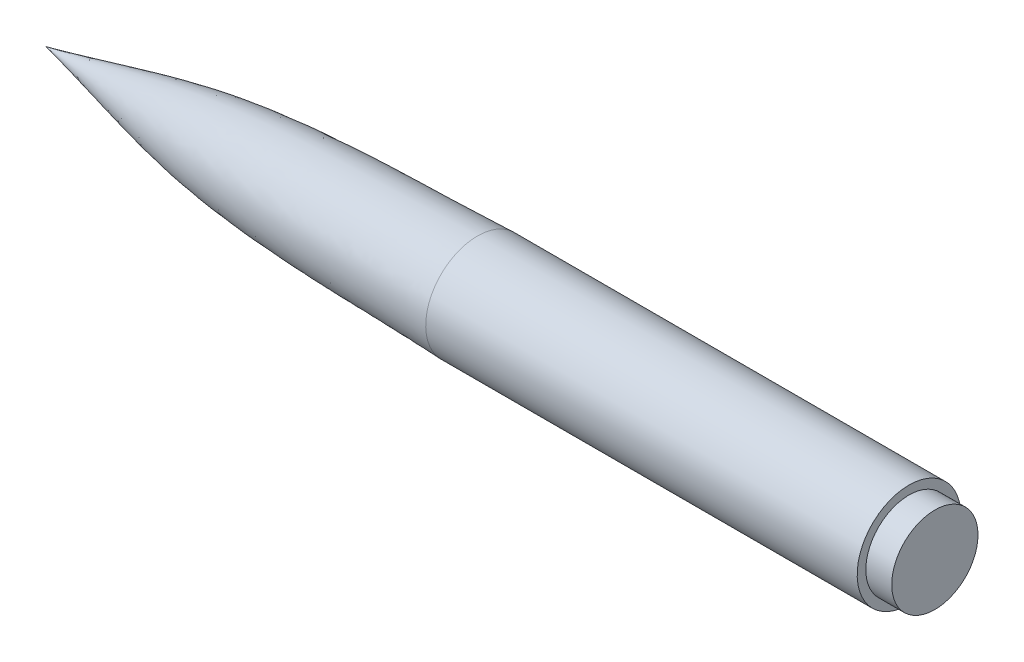
ISO-10303-21;
HEADER;
FILE_DESCRIPTION(('STEP AP214'),'2;1');
FILE_NAME('part.step','',(''),(''),'','','');
FILE_SCHEMA(('AUTOMOTIVE_DESIGN { 1 0 10303 214 1 1 1 1 }'));
ENDSEC;
DATA;
#1=APPLICATION_CONTEXT('core data for automotive mechanical design processes');
#2=APPLICATION_PROTOCOL_DEFINITION('international standard','automotive_design',2000,#1);
#3=PRODUCT_CONTEXT('',#1,'mechanical');
#4=PRODUCT('Part','Part','',(#3));
#5=PRODUCT_RELATED_PRODUCT_CATEGORY('part','',(#4));
#6=PRODUCT_DEFINITION_FORMATION('','',#4);
#7=PRODUCT_DEFINITION_CONTEXT('part definition',#1,'design');
#8=PRODUCT_DEFINITION('design','',#6,#7);
#9=PRODUCT_DEFINITION_SHAPE('','',#8);
#10=(LENGTH_UNIT() NAMED_UNIT(*) SI_UNIT(.MILLI.,.METRE.));
#11=(NAMED_UNIT(*) PLANE_ANGLE_UNIT() SI_UNIT($,.RADIAN.));
#12=(NAMED_UNIT(*) SI_UNIT($,.STERADIAN.) SOLID_ANGLE_UNIT());
#13=UNCERTAINTY_MEASURE_WITH_UNIT(LENGTH_MEASURE(1.E-05),#10,'distance_accuracy_value','');
#14=(GEOMETRIC_REPRESENTATION_CONTEXT(3) GLOBAL_UNCERTAINTY_ASSIGNED_CONTEXT((#13)) GLOBAL_UNIT_ASSIGNED_CONTEXT((#10,
#11,#12)) REPRESENTATION_CONTEXT('',''));
#15=CARTESIAN_POINT('',(0.,0.,0.));
#16=DIRECTION('',(0.,0.,1.));
#17=DIRECTION('',(1.,0.,0.));
#18=AXIS2_PLACEMENT_3D('',#15,#16,#17);
#19=CARTESIAN_POINT('',(250.,0.,0.));
#20=DIRECTION('',(-1.,0.,0.));
#21=DIRECTION('',(0.,0.,1.));
#22=AXIS2_PLACEMENT_3D('',#19,#20,#21);
#23=CYLINDRICAL_SURFACE('',#22,30.);
#24=CARTESIAN_POINT('',(250.,0.,0.));
#25=DIRECTION('',(1.,0.,0.));
#26=DIRECTION('',(0.,0.,-1.));
#27=AXIS2_PLACEMENT_3D('',#24,#25,#26);
#28=CIRCLE('',#27,30.);
#29=CARTESIAN_POINT('',(250.,0.,-30.));
#30=VERTEX_POINT('',#29);
#31=EDGE_CURVE('E38',#30,#30,#28,.T.);
#32=ORIENTED_EDGE('',*,*,#31,.F.);
#33=EDGE_LOOP('',(#32));
#34=FACE_BOUND('',#33,.T.);
#35=CARTESIAN_POINT('',(0.,0.,0.));
#36=DIRECTION('',(1.,0.,0.));
#37=DIRECTION('',(0.,1.,0.));
#38=AXIS2_PLACEMENT_3D('',#35,#36,#37);
#39=CIRCLE('',#38,30.);
#40=CARTESIAN_POINT('',(0.,30.,0.));
#41=VERTEX_POINT('',#40);
#42=EDGE_CURVE('E51',#41,#41,#39,.T.);
#43=ORIENTED_EDGE('',*,*,#42,.T.);
#44=EDGE_LOOP('',(#43));
#45=FACE_BOUND('',#44,.T.);
#46=ADVANCED_FACE('F35',(#34,#45),#23,.T.);
#47=CARTESIAN_POINT('',(250.,0.,0.));
#48=DIRECTION('',(1.,0.,0.));
#49=DIRECTION('',(0.,0.,-1.));
#50=AXIS2_PLACEMENT_3D('',#47,#48,#49);
#51=PLANE('',#50);
#52=CARTESIAN_POINT('',(250.,0.,0.));
#53=DIRECTION('',(1.,0.,0.));
#54=DIRECTION('',(0.,0.,-1.));
#55=AXIS2_PLACEMENT_3D('',#52,#53,#54);
#56=CIRCLE('',#55,25.);
#57=CARTESIAN_POINT('',(250.,0.,-25.));
#58=VERTEX_POINT('',#57);
#59=EDGE_CURVE('E11',#58,#58,#56,.T.);
#60=ORIENTED_EDGE('',*,*,#59,.F.);
#61=EDGE_LOOP('',(#60));
#62=FACE_BOUND('',#61,.T.);
#63=ORIENTED_EDGE('',*,*,#31,.T.);
#64=EDGE_LOOP('',(#63));
#65=FACE_BOUND('',#64,.T.);
#66=ADVANCED_FACE('F70',(#62,#65),#51,.T.);
#67=CARTESIAN_POINT('',(265.,0.,0.));
#68=DIRECTION('',(-1.,0.,0.));
#69=DIRECTION('',(0.,0.,1.));
#70=AXIS2_PLACEMENT_3D('',#67,#68,#69);
#71=CYLINDRICAL_SURFACE('',#70,25.);
#72=CARTESIAN_POINT('',(265.,0.,0.));
#73=DIRECTION('',(1.,0.,0.));
#74=DIRECTION('',(0.,0.,-1.));
#75=AXIS2_PLACEMENT_3D('',#72,#73,#74);
#76=CIRCLE('',#75,25.);
#77=CARTESIAN_POINT('',(265.,0.,-25.));
#78=VERTEX_POINT('',#77);
#79=EDGE_CURVE('E53',#78,#78,#76,.T.);
#80=ORIENTED_EDGE('',*,*,#79,.F.);
#81=EDGE_LOOP('',(#80));
#82=FACE_BOUND('',#81,.T.);
#83=ORIENTED_EDGE('',*,*,#59,.T.);
#84=EDGE_LOOP('',(#83));
#85=FACE_BOUND('',#84,.T.);
#86=ADVANCED_FACE('F67',(#82,#85),#71,.T.);
#87=CARTESIAN_POINT('',(265.,0.,0.));
#88=DIRECTION('',(1.,0.,0.));
#89=DIRECTION('',(0.,0.,-1.));
#90=AXIS2_PLACEMENT_3D('',#87,#88,#89);
#91=PLANE('',#90);
#92=ORIENTED_EDGE('',*,*,#79,.T.);
#93=EDGE_LOOP('',(#92));
#94=FACE_BOUND('',#93,.T.);
#95=ADVANCED_FACE('F47',(#94),#91,.T.);
#96=CARTESIAN_POINT('',(0.,30.,0.));
#97=CARTESIAN_POINT('',(-54.4987099615294,27.7738243591195,0.));
#98=CARTESIAN_POINT('',(-140.370037822991,29.8325306311207,0.));
#99=CARTESIAN_POINT('',(-221.595628815123,6.1564038988753,0.));
#100=CARTESIAN_POINT('',(-250.,0.,0.));
#101=B_SPLINE_CURVE_WITH_KNOTS('',3,(#96,#97,#98,#99,#100),.UNSPECIFIED.,.F.,.F.,(4,1,4),(0.,
0.654663370793014,1.),.UNSPECIFIED.);
#102=CARTESIAN_POINT('',(0.,0.,0.));
#103=DIRECTION('',(1.,0.,0.));
#104=AXIS1_PLACEMENT('',#102,#103);
#105=SURFACE_OF_REVOLUTION('',#101,#104);
#106=CARTESIAN_POINT('',(-250.,0.,0.));
#107=VERTEX_POINT('',#106);
#108=VERTEX_LOOP('',#107);
#109=FACE_BOUND('',#108,.T.);
#110=ORIENTED_EDGE('',*,*,#42,.F.);
#111=EDGE_LOOP('',(#110));
#112=FACE_BOUND('',#111,.T.);
#113=ADVANCED_FACE('F44',(#109,#112),#105,.F.);
#114=CLOSED_SHELL('',(#46,#66,#86,#95,#113));
#115=MANIFOLD_SOLID_BREP('B2',#114);
#116=ADVANCED_BREP_SHAPE_REPRESENTATION('',(#18,#115),#14);
#117=SHAPE_DEFINITION_REPRESENTATION(#9,#116);
ENDSEC;
END-ISO-10303-21;
